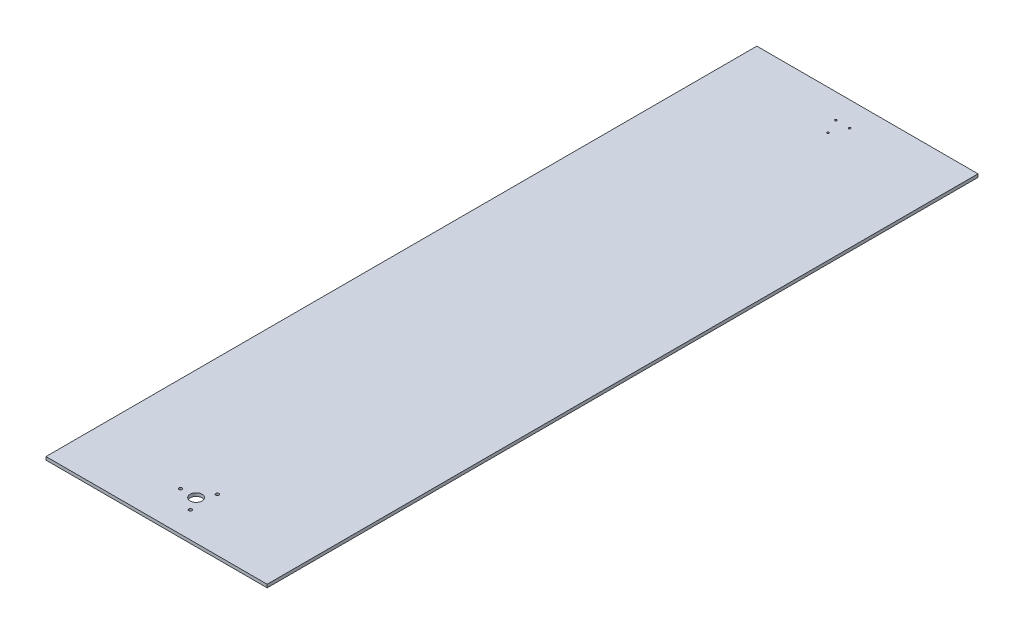
ISO-10303-21;
HEADER;
FILE_DESCRIPTION(('STEP AP214'),'2;1');
FILE_NAME('part.step','',(''),(''),'','','');
FILE_SCHEMA(('AUTOMOTIVE_DESIGN { 1 0 10303 214 1 1 1 1 }'));
ENDSEC;
DATA;
#1=APPLICATION_CONTEXT('core data for automotive mechanical design processes');
#2=APPLICATION_PROTOCOL_DEFINITION('international standard','automotive_design',2000,#1);
#3=PRODUCT_CONTEXT('',#1,'mechanical');
#4=PRODUCT('Part','Part','',(#3));
#5=PRODUCT_RELATED_PRODUCT_CATEGORY('part','',(#4));
#6=PRODUCT_DEFINITION_FORMATION('','',#4);
#7=PRODUCT_DEFINITION_CONTEXT('part definition',#1,'design');
#8=PRODUCT_DEFINITION('design','',#6,#7);
#9=PRODUCT_DEFINITION_SHAPE('','',#8);
#10=(LENGTH_UNIT() NAMED_UNIT(*) SI_UNIT(.MILLI.,.METRE.));
#11=(NAMED_UNIT(*) PLANE_ANGLE_UNIT() SI_UNIT($,.RADIAN.));
#12=(NAMED_UNIT(*) SI_UNIT($,.STERADIAN.) SOLID_ANGLE_UNIT());
#13=UNCERTAINTY_MEASURE_WITH_UNIT(LENGTH_MEASURE(1.E-05),#10,'distance_accuracy_value','');
#14=(GEOMETRIC_REPRESENTATION_CONTEXT(3) GLOBAL_UNCERTAINTY_ASSIGNED_CONTEXT((#13)) GLOBAL_UNIT_ASSIGNED_CONTEXT((#10,
#11,#12)) REPRESENTATION_CONTEXT('',''));
#15=CARTESIAN_POINT('',(0.,0.,0.));
#16=DIRECTION('',(0.,0.,1.));
#17=DIRECTION('',(1.,0.,0.));
#18=AXIS2_PLACEMENT_3D('',#15,#16,#17);
#19=CARTESIAN_POINT('',(0.,5.08,0.));
#20=DIRECTION('',(0.,1.,0.));
#21=DIRECTION('',(0.,0.,1.));
#22=AXIS2_PLACEMENT_3D('',#19,#20,#21);
#23=PLANE('',#22);
#24=CARTESIAN_POINT('',(-11.1125,5.08,-1039.8125));
#25=DIRECTION('',(0.,1.,0.));
#26=DIRECTION('',(0.,0.,1.));
#27=AXIS2_PLACEMENT_3D('',#24,#25,#26);
#28=CIRCLE('',#27,1.58749999999994);
#29=CARTESIAN_POINT('',(-11.1125,5.08,-1038.225));
#30=VERTEX_POINT('',#29);
#31=EDGE_CURVE('E95',#30,#30,#28,.T.);
#32=ORIENTED_EDGE('',*,*,#31,.F.);
#33=EDGE_LOOP('',(#32));
#34=FACE_BOUND('',#33,.T.);
#35=CARTESIAN_POINT('',(11.1125,5.08,-1039.8125));
#36=DIRECTION('',(0.,1.,0.));
#37=DIRECTION('',(0.,0.,1.));
#38=AXIS2_PLACEMENT_3D('',#35,#36,#37);
#39=CIRCLE('',#38,1.58749999999994);
#40=CARTESIAN_POINT('',(11.1125,5.08,-1038.225));
#41=VERTEX_POINT('',#40);
#42=EDGE_CURVE('E190',#41,#41,#39,.T.);
#43=ORIENTED_EDGE('',*,*,#42,.F.);
#44=EDGE_LOOP('',(#43));
#45=FACE_BOUND('',#44,.T.);
#46=CARTESIAN_POINT('',(0.,5.08,-1016.));
#47=DIRECTION('',(0.,1.,0.));
#48=DIRECTION('',(0.,0.,1.));
#49=AXIS2_PLACEMENT_3D('',#46,#47,#48);
#50=CIRCLE('',#49,1.58749999999998);
#51=CARTESIAN_POINT('',(0.,5.08,-1014.4125));
#52=VERTEX_POINT('',#51);
#53=EDGE_CURVE('E198',#52,#52,#50,.T.);
#54=ORIENTED_EDGE('',*,*,#53,.F.);
#55=EDGE_LOOP('',(#54));
#56=FACE_BOUND('',#55,.T.);
#57=CARTESIAN_POINT('',(12.5,5.08,21.650635094611));
#58=DIRECTION('',(0.,1.,0.));
#59=DIRECTION('',(0.,0.,1.));
#60=AXIS2_PLACEMENT_3D('',#57,#58,#59);
#61=CIRCLE('',#60,2.5527);
#62=CARTESIAN_POINT('',(12.5,5.08,24.203335094611));
#63=VERTEX_POINT('',#62);
#64=EDGE_CURVE('E109',#63,#63,#61,.T.);
#65=ORIENTED_EDGE('',*,*,#64,.F.);
#66=EDGE_LOOP('',(#65));
#67=FACE_BOUND('',#66,.T.);
#68=CARTESIAN_POINT('',(0.,5.08,0.));
#69=DIRECTION('',(0.,1.,0.));
#70=DIRECTION('',(0.,0.,1.));
#71=AXIS2_PLACEMENT_3D('',#68,#69,#70);
#72=CIRCLE('',#71,9.525);
#73=CARTESIAN_POINT('',(0.,5.08,9.52500000000001));
#74=VERTEX_POINT('',#73);
#75=EDGE_CURVE('E121',#74,#74,#72,.T.);
#76=ORIENTED_EDGE('',*,*,#75,.F.);
#77=EDGE_LOOP('',(#76));
#78=FACE_BOUND('',#77,.T.);
#79=DIRECTION('',(0.,0.,1.));
#80=VECTOR('',#79,1.);
#81=CARTESIAN_POINT('',(-177.8,5.08,63.5));
#82=LINE('',#81,#80);
#83=CARTESIAN_POINT('',(-177.8,5.08,-1079.5));
#84=VERTEX_POINT('',#83);
#85=CARTESIAN_POINT('',(-177.8,5.08,63.5));
#86=VERTEX_POINT('',#85);
#87=EDGE_CURVE('E127',#84,#86,#82,.T.);
#88=ORIENTED_EDGE('',*,*,#87,.T.);
#89=DIRECTION('',(1.,0.,0.));
#90=VECTOR('',#89,1.);
#91=CARTESIAN_POINT('',(177.8,5.08,63.5));
#92=LINE('',#91,#90);
#93=CARTESIAN_POINT('',(177.8,5.08,63.5));
#94=VERTEX_POINT('',#93);
#95=EDGE_CURVE('E50',#86,#94,#92,.T.);
#96=ORIENTED_EDGE('',*,*,#95,.T.);
#97=DIRECTION('',(0.,0.,-1.));
#98=VECTOR('',#97,1.);
#99=CARTESIAN_POINT('',(177.8,5.08,63.5));
#100=LINE('',#99,#98);
#101=CARTESIAN_POINT('',(177.8,5.08,-1079.5));
#102=VERTEX_POINT('',#101);
#103=EDGE_CURVE('E77',#94,#102,#100,.T.);
#104=ORIENTED_EDGE('',*,*,#103,.T.);
#105=DIRECTION('',(-1.,0.,0.));
#106=VECTOR('',#105,1.);
#107=CARTESIAN_POINT('',(-177.8,5.08,-1079.5));
#108=LINE('',#107,#106);
#109=EDGE_CURVE('E80',#102,#84,#108,.T.);
#110=ORIENTED_EDGE('',*,*,#109,.T.);
#111=EDGE_LOOP('',(#88,#96,#104,#110));
#112=FACE_BOUND('',#111,.T.);
#113=CARTESIAN_POINT('',(12.5,5.08,-21.650635094611));
#114=DIRECTION('',(0.,1.,0.));
#115=DIRECTION('',(0.,0.,1.));
#116=AXIS2_PLACEMENT_3D('',#113,#114,#115);
#117=CIRCLE('',#116,2.5527);
#118=CARTESIAN_POINT('',(12.5,5.08,-19.097935094611));
#119=VERTEX_POINT('',#118);
#120=EDGE_CURVE('E115',#119,#119,#117,.T.);
#121=ORIENTED_EDGE('',*,*,#120,.F.);
#122=EDGE_LOOP('',(#121));
#123=FACE_BOUND('',#122,.T.);
#124=CARTESIAN_POINT('',(-25.,5.08,0.));
#125=DIRECTION('',(0.,1.,0.));
#126=DIRECTION('',(0.,0.,1.));
#127=AXIS2_PLACEMENT_3D('',#124,#125,#126);
#128=CIRCLE('',#127,2.5527);
#129=CARTESIAN_POINT('',(-25.,5.08,2.5527));
#130=VERTEX_POINT('',#129);
#131=EDGE_CURVE('E102',#130,#130,#128,.T.);
#132=ORIENTED_EDGE('',*,*,#131,.F.);
#133=EDGE_LOOP('',(#132));
#134=FACE_BOUND('',#133,.T.);
#135=ADVANCED_FACE('F33',(#34,#45,#56,#67,#78,#112,#123,#134),#23,.T.);
#136=CARTESIAN_POINT('',(0.,0.,0.));
#137=DIRECTION('',(0.,1.,0.));
#138=DIRECTION('',(0.,0.,1.));
#139=AXIS2_PLACEMENT_3D('',#136,#137,#138);
#140=PLANE('',#139);
#141=CARTESIAN_POINT('',(-11.1125,0.,-1039.8125));
#142=DIRECTION('',(0.,1.,0.));
#143=DIRECTION('',(0.,0.,1.));
#144=AXIS2_PLACEMENT_3D('',#141,#142,#143);
#145=CIRCLE('',#144,1.58749999999994);
#146=CARTESIAN_POINT('',(-11.1125,0.,-1038.225));
#147=VERTEX_POINT('',#146);
#148=EDGE_CURVE('E92',#147,#147,#145,.T.);
#149=ORIENTED_EDGE('',*,*,#148,.T.);
#150=EDGE_LOOP('',(#149));
#151=FACE_BOUND('',#150,.T.);
#152=CARTESIAN_POINT('',(11.1125,0.,-1039.8125));
#153=DIRECTION('',(0.,1.,0.));
#154=DIRECTION('',(0.,0.,1.));
#155=AXIS2_PLACEMENT_3D('',#152,#153,#154);
#156=CIRCLE('',#155,1.58749999999994);
#157=CARTESIAN_POINT('',(11.1125,0.,-1038.225));
#158=VERTEX_POINT('',#157);
#159=EDGE_CURVE('E193',#158,#158,#156,.T.);
#160=ORIENTED_EDGE('',*,*,#159,.T.);
#161=EDGE_LOOP('',(#160));
#162=FACE_BOUND('',#161,.T.);
#163=CARTESIAN_POINT('',(0.,0.,-1016.));
#164=DIRECTION('',(0.,1.,0.));
#165=DIRECTION('',(0.,0.,1.));
#166=AXIS2_PLACEMENT_3D('',#163,#164,#165);
#167=CIRCLE('',#166,1.58749999999998);
#168=CARTESIAN_POINT('',(0.,0.,-1014.4125));
#169=VERTEX_POINT('',#168);
#170=EDGE_CURVE('E200',#169,#169,#167,.T.);
#171=ORIENTED_EDGE('',*,*,#170,.T.);
#172=EDGE_LOOP('',(#171));
#173=FACE_BOUND('',#172,.T.);
#174=DIRECTION('',(0.,0.,1.));
#175=VECTOR('',#174,1.);
#176=CARTESIAN_POINT('',(-177.8,0.,63.5));
#177=LINE('',#176,#175);
#178=CARTESIAN_POINT('',(-177.8,0.,-1079.5));
#179=VERTEX_POINT('',#178);
#180=CARTESIAN_POINT('',(-177.8,0.,63.5));
#181=VERTEX_POINT('',#180);
#182=EDGE_CURVE('E124',#179,#181,#177,.T.);
#183=ORIENTED_EDGE('',*,*,#182,.F.);
#184=DIRECTION('',(1.,0.,0.));
#185=VECTOR('',#184,1.);
#186=CARTESIAN_POINT('',(-177.8,0.,-1079.5));
#187=LINE('',#186,#185);
#188=CARTESIAN_POINT('',(177.8,0.,-1079.5));
#189=VERTEX_POINT('',#188);
#190=EDGE_CURVE('E99',#179,#189,#187,.T.);
#191=ORIENTED_EDGE('',*,*,#190,.T.);
#192=DIRECTION('',(0.,0.,-1.));
#193=VECTOR('',#192,1.);
#194=CARTESIAN_POINT('',(177.8,0.,63.5));
#195=LINE('',#194,#193);
#196=CARTESIAN_POINT('',(177.8,0.,63.5));
#197=VERTEX_POINT('',#196);
#198=EDGE_CURVE('E68',#197,#189,#195,.T.);
#199=ORIENTED_EDGE('',*,*,#198,.F.);
#200=DIRECTION('',(1.,0.,0.));
#201=VECTOR('',#200,1.);
#202=CARTESIAN_POINT('',(177.8,0.,63.5));
#203=LINE('',#202,#201);
#204=EDGE_CURVE('E61',#181,#197,#203,.T.);
#205=ORIENTED_EDGE('',*,*,#204,.F.);
#206=EDGE_LOOP('',(#183,#191,#199,#205));
#207=FACE_BOUND('',#206,.T.);
#208=CARTESIAN_POINT('',(0.,0.,0.));
#209=DIRECTION('',(0.,1.,0.));
#210=DIRECTION('',(0.,0.,1.));
#211=AXIS2_PLACEMENT_3D('',#208,#209,#210);
#212=CIRCLE('',#211,9.525);
#213=CARTESIAN_POINT('',(0.,0.,9.52500000000001));
#214=VERTEX_POINT('',#213);
#215=EDGE_CURVE('E118',#214,#214,#212,.T.);
#216=ORIENTED_EDGE('',*,*,#215,.T.);
#217=EDGE_LOOP('',(#216));
#218=FACE_BOUND('',#217,.T.);
#219=CARTESIAN_POINT('',(12.5,0.,-21.650635094611));
#220=DIRECTION('',(0.,1.,0.));
#221=DIRECTION('',(0.,0.,1.));
#222=AXIS2_PLACEMENT_3D('',#219,#220,#221);
#223=CIRCLE('',#222,2.5527);
#224=CARTESIAN_POINT('',(12.5,0.,-19.097935094611));
#225=VERTEX_POINT('',#224);
#226=EDGE_CURVE('E112',#225,#225,#223,.T.);
#227=ORIENTED_EDGE('',*,*,#226,.T.);
#228=EDGE_LOOP('',(#227));
#229=FACE_BOUND('',#228,.T.);
#230=CARTESIAN_POINT('',(12.5,0.,21.650635094611));
#231=DIRECTION('',(0.,1.,0.));
#232=DIRECTION('',(0.,0.,1.));
#233=AXIS2_PLACEMENT_3D('',#230,#231,#232);
#234=CIRCLE('',#233,2.5527);
#235=CARTESIAN_POINT('',(12.5,0.,24.203335094611));
#236=VERTEX_POINT('',#235);
#237=EDGE_CURVE('E105',#236,#236,#234,.T.);
#238=ORIENTED_EDGE('',*,*,#237,.T.);
#239=EDGE_LOOP('',(#238));
#240=FACE_BOUND('',#239,.T.);
#241=CARTESIAN_POINT('',(-25.,0.,0.));
#242=DIRECTION('',(0.,1.,0.));
#243=DIRECTION('',(0.,0.,1.));
#244=AXIS2_PLACEMENT_3D('',#241,#242,#243);
#245=CIRCLE('',#244,2.5527);
#246=CARTESIAN_POINT('',(-25.,0.,2.5527));
#247=VERTEX_POINT('',#246);
#248=EDGE_CURVE('E106',#247,#247,#245,.T.);
#249=ORIENTED_EDGE('',*,*,#248,.T.);
#250=EDGE_LOOP('',(#249));
#251=FACE_BOUND('',#250,.T.);
#252=ADVANCED_FACE('F134',(#151,#162,#173,#207,#218,#229,#240,#251),#140,.F.);
#253=CARTESIAN_POINT('',(-177.8,5.08,63.5));
#254=DIRECTION('',(1.,0.,0.));
#255=DIRECTION('',(0.,0.,-1.));
#256=AXIS2_PLACEMENT_3D('',#253,#254,#255);
#257=PLANE('',#256);
#258=ORIENTED_EDGE('',*,*,#182,.T.);
#259=DIRECTION('',(0.,-1.,0.));
#260=VECTOR('',#259,1.);
#261=CARTESIAN_POINT('',(-177.8,5.08,63.5));
#262=LINE('',#261,#260);
#263=EDGE_CURVE('E11',#86,#181,#262,.T.);
#264=ORIENTED_EDGE('',*,*,#263,.F.);
#265=ORIENTED_EDGE('',*,*,#87,.F.);
#266=DIRECTION('',(0.,1.,0.));
#267=VECTOR('',#266,1.);
#268=CARTESIAN_POINT('',(-177.8,-1076.43270110119,-1079.5));
#269=LINE('',#268,#267);
#270=EDGE_CURVE('E87',#179,#84,#269,.T.);
#271=ORIENTED_EDGE('',*,*,#270,.F.);
#272=EDGE_LOOP('',(#258,#264,#265,#271));
#273=FACE_BOUND('',#272,.T.);
#274=ADVANCED_FACE('F35',(#273),#257,.F.);
#275=CARTESIAN_POINT('',(177.8,5.08,63.5));
#276=DIRECTION('',(0.,0.,-1.));
#277=DIRECTION('',(-1.,0.,0.));
#278=AXIS2_PLACEMENT_3D('',#275,#276,#277);
#279=PLANE('',#278);
#280=ORIENTED_EDGE('',*,*,#204,.T.);
#281=DIRECTION('',(0.,-1.,0.));
#282=VECTOR('',#281,1.);
#283=CARTESIAN_POINT('',(177.8,5.08,63.5));
#284=LINE('',#283,#282);
#285=EDGE_CURVE('E42',#94,#197,#284,.T.);
#286=ORIENTED_EDGE('',*,*,#285,.F.);
#287=ORIENTED_EDGE('',*,*,#95,.F.);
#288=ORIENTED_EDGE('',*,*,#263,.T.);
#289=EDGE_LOOP('',(#280,#286,#287,#288));
#290=FACE_BOUND('',#289,.T.);
#291=ADVANCED_FACE('F138',(#290),#279,.F.);
#292=CARTESIAN_POINT('',(177.8,5.08,63.5));
#293=DIRECTION('',(-1.,0.,0.));
#294=DIRECTION('',(0.,0.,1.));
#295=AXIS2_PLACEMENT_3D('',#292,#293,#294);
#296=PLANE('',#295);
#297=ORIENTED_EDGE('',*,*,#198,.T.);
#298=DIRECTION('',(0.,1.,0.));
#299=VECTOR('',#298,1.);
#300=CARTESIAN_POINT('',(177.8,-1076.43270110119,-1079.5));
#301=LINE('',#300,#299);
#302=EDGE_CURVE('E83',#189,#102,#301,.T.);
#303=ORIENTED_EDGE('',*,*,#302,.T.);
#304=ORIENTED_EDGE('',*,*,#103,.F.);
#305=ORIENTED_EDGE('',*,*,#285,.T.);
#306=EDGE_LOOP('',(#297,#303,#304,#305));
#307=FACE_BOUND('',#306,.T.);
#308=ADVANCED_FACE('F84',(#307),#296,.F.);
#309=CARTESIAN_POINT('',(0.,5.08,0.));
#310=DIRECTION('',(0.,-1.,0.));
#311=DIRECTION('',(0.,0.,-1.));
#312=AXIS2_PLACEMENT_3D('',#309,#310,#311);
#313=CYLINDRICAL_SURFACE('',#312,9.525);
#314=ORIENTED_EDGE('',*,*,#75,.T.);
#315=EDGE_LOOP('',(#314));
#316=FACE_BOUND('',#315,.T.);
#317=ORIENTED_EDGE('',*,*,#215,.F.);
#318=EDGE_LOOP('',(#317));
#319=FACE_BOUND('',#318,.T.);
#320=ADVANCED_FACE('F144',(#316,#319),#313,.F.);
#321=CARTESIAN_POINT('',(12.5,5.08,-21.650635094611));
#322=DIRECTION('',(0.,-1.,0.));
#323=DIRECTION('',(0.,0.,-1.));
#324=AXIS2_PLACEMENT_3D('',#321,#322,#323);
#325=CYLINDRICAL_SURFACE('',#324,2.5527);
#326=ORIENTED_EDGE('',*,*,#120,.T.);
#327=EDGE_LOOP('',(#326));
#328=FACE_BOUND('',#327,.T.);
#329=ORIENTED_EDGE('',*,*,#226,.F.);
#330=EDGE_LOOP('',(#329));
#331=FACE_BOUND('',#330,.T.);
#332=ADVANCED_FACE('F159',(#328,#331),#325,.F.);
#333=CARTESIAN_POINT('',(12.5,5.08,21.650635094611));
#334=DIRECTION('',(0.,-1.,0.));
#335=DIRECTION('',(0.,0.,-1.));
#336=AXIS2_PLACEMENT_3D('',#333,#334,#335);
#337=CYLINDRICAL_SURFACE('',#336,2.5527);
#338=ORIENTED_EDGE('',*,*,#64,.T.);
#339=EDGE_LOOP('',(#338));
#340=FACE_BOUND('',#339,.T.);
#341=ORIENTED_EDGE('',*,*,#237,.F.);
#342=EDGE_LOOP('',(#341));
#343=FACE_BOUND('',#342,.T.);
#344=ADVANCED_FACE('F163',(#340,#343),#337,.F.);
#345=CARTESIAN_POINT('',(-25.,5.08,0.));
#346=DIRECTION('',(0.,-1.,0.));
#347=DIRECTION('',(0.,0.,-1.));
#348=AXIS2_PLACEMENT_3D('',#345,#346,#347);
#349=CYLINDRICAL_SURFACE('',#348,2.5527);
#350=ORIENTED_EDGE('',*,*,#131,.T.);
#351=EDGE_LOOP('',(#350));
#352=FACE_BOUND('',#351,.T.);
#353=ORIENTED_EDGE('',*,*,#248,.F.);
#354=EDGE_LOOP('',(#353));
#355=FACE_BOUND('',#354,.T.);
#356=ADVANCED_FACE('F167',(#352,#355),#349,.F.);
#357=CARTESIAN_POINT('',(-177.8,-1076.43270110119,-1079.5));
#358=DIRECTION('',(0.,0.,-1.));
#359=DIRECTION('',(-1.,0.,0.));
#360=AXIS2_PLACEMENT_3D('',#357,#358,#359);
#361=PLANE('',#360);
#362=ORIENTED_EDGE('',*,*,#190,.F.);
#363=ORIENTED_EDGE('',*,*,#270,.T.);
#364=ORIENTED_EDGE('',*,*,#109,.F.);
#365=ORIENTED_EDGE('',*,*,#302,.F.);
#366=EDGE_LOOP('',(#362,#363,#364,#365));
#367=FACE_BOUND('',#366,.T.);
#368=ADVANCED_FACE('F90',(#367),#361,.T.);
#369=CARTESIAN_POINT('',(0.,0.,-1016.));
#370=DIRECTION('',(0.,1.,0.));
#371=DIRECTION('',(0.,0.,1.));
#372=AXIS2_PLACEMENT_3D('',#369,#370,#371);
#373=CYLINDRICAL_SURFACE('',#372,1.58749999999998);
#374=ORIENTED_EDGE('',*,*,#170,.F.);
#375=EDGE_LOOP('',(#374));
#376=FACE_BOUND('',#375,.T.);
#377=ORIENTED_EDGE('',*,*,#53,.T.);
#378=EDGE_LOOP('',(#377));
#379=FACE_BOUND('',#378,.T.);
#380=ADVANCED_FACE('F174',(#376,#379),#373,.F.);
#381=CARTESIAN_POINT('',(11.1125,0.,-1039.8125));
#382=DIRECTION('',(0.,1.,0.));
#383=DIRECTION('',(0.,0.,1.));
#384=AXIS2_PLACEMENT_3D('',#381,#382,#383);
#385=CYLINDRICAL_SURFACE('',#384,1.58749999999994);
#386=ORIENTED_EDGE('',*,*,#159,.F.);
#387=EDGE_LOOP('',(#386));
#388=FACE_BOUND('',#387,.T.);
#389=ORIENTED_EDGE('',*,*,#42,.T.);
#390=EDGE_LOOP('',(#389));
#391=FACE_BOUND('',#390,.T.);
#392=ADVANCED_FACE('F177',(#388,#391),#385,.F.);
#393=CARTESIAN_POINT('',(-11.1125,0.,-1039.8125));
#394=DIRECTION('',(0.,1.,0.));
#395=DIRECTION('',(0.,0.,1.));
#396=AXIS2_PLACEMENT_3D('',#393,#394,#395);
#397=CYLINDRICAL_SURFACE('',#396,1.58749999999994);
#398=ORIENTED_EDGE('',*,*,#148,.F.);
#399=EDGE_LOOP('',(#398));
#400=FACE_BOUND('',#399,.T.);
#401=ORIENTED_EDGE('',*,*,#31,.T.);
#402=EDGE_LOOP('',(#401));
#403=FACE_BOUND('',#402,.T.);
#404=ADVANCED_FACE('F181',(#400,#403),#397,.F.);
#405=CLOSED_SHELL('',(#135,#252,#274,#291,#308,#320,#332,#344,#356,#368,#380,#392,#404));
#406=MANIFOLD_SOLID_BREP('B2',#405);
#407=ADVANCED_BREP_SHAPE_REPRESENTATION('',(#18,#406),#14);
#408=SHAPE_DEFINITION_REPRESENTATION(#9,#407);
ENDSEC;
END-ISO-10303-21;
